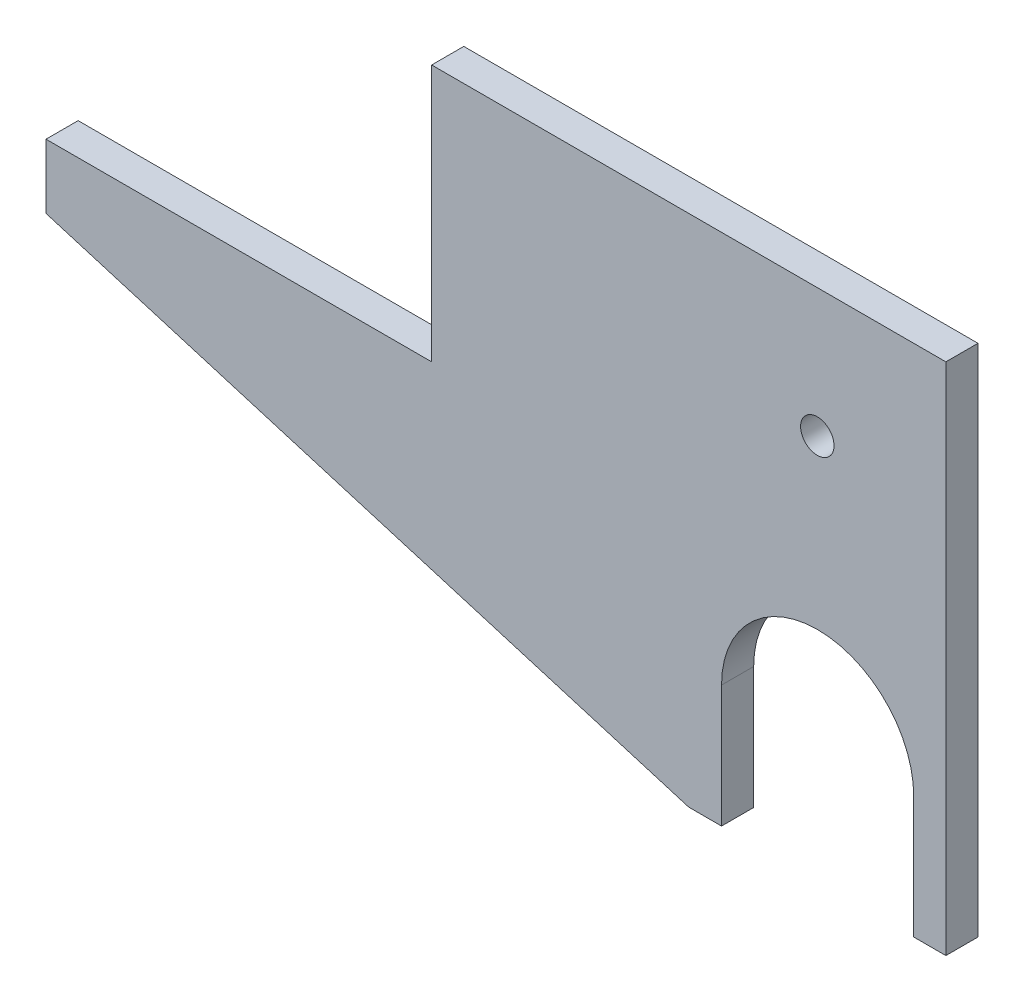
ISO-10303-21;
HEADER;
FILE_DESCRIPTION(('STEP AP214'),'2;1');
FILE_NAME('part.step','',(''),(''),'','','');
FILE_SCHEMA(('AUTOMOTIVE_DESIGN { 1 0 10303 214 1 1 1 1 }'));
ENDSEC;
DATA;
#1=APPLICATION_CONTEXT('core data for automotive mechanical design processes');
#2=APPLICATION_PROTOCOL_DEFINITION('international standard','automotive_design',2000,#1);
#3=PRODUCT_CONTEXT('',#1,'mechanical');
#4=PRODUCT('Part','Part','',(#3));
#5=PRODUCT_RELATED_PRODUCT_CATEGORY('part','',(#4));
#6=PRODUCT_DEFINITION_FORMATION('','',#4);
#7=PRODUCT_DEFINITION_CONTEXT('part definition',#1,'design');
#8=PRODUCT_DEFINITION('design','',#6,#7);
#9=PRODUCT_DEFINITION_SHAPE('','',#8);
#10=(LENGTH_UNIT() NAMED_UNIT(*) SI_UNIT(.MILLI.,.METRE.));
#11=(NAMED_UNIT(*) PLANE_ANGLE_UNIT() SI_UNIT($,.RADIAN.));
#12=(NAMED_UNIT(*) SI_UNIT($,.STERADIAN.) SOLID_ANGLE_UNIT());
#13=UNCERTAINTY_MEASURE_WITH_UNIT(LENGTH_MEASURE(1.E-05),#10,'distance_accuracy_value','');
#14=(GEOMETRIC_REPRESENTATION_CONTEXT(3) GLOBAL_UNCERTAINTY_ASSIGNED_CONTEXT((#13)) GLOBAL_UNIT_ASSIGNED_CONTEXT((#10,
#11,#12)) REPRESENTATION_CONTEXT('',''));
#15=CARTESIAN_POINT('',(0.,0.,0.));
#16=DIRECTION('',(0.,0.,1.));
#17=DIRECTION('',(1.,0.,0.));
#18=AXIS2_PLACEMENT_3D('',#15,#16,#17);
#19=CARTESIAN_POINT('',(990.663500000006,-26.6699999999984,6.34999999999986));
#20=DIRECTION('',(0.,0.,-1.));
#21=DIRECTION('',(-1.00000000000001,0.,0.));
#22=AXIS2_PLACEMENT_3D('',#19,#20,#21);
#23=CYLINDRICAL_SURFACE('',#22,18.9865);
#24=CARTESIAN_POINT('',(990.663500000006,-26.6699999999984,0.));
#25=DIRECTION('',(0.,0.,1.));
#26=DIRECTION('',(1.00000000000001,0.,0.));
#27=AXIS2_PLACEMENT_3D('',#24,#25,#26);
#28=CIRCLE('',#27,18.9865);
#29=CARTESIAN_POINT('',(1009.65000000001,-26.6699999999984,7.7715611723761E-13));
#30=VERTEX_POINT('',#29);
#31=CARTESIAN_POINT('',(971.677000000006,-26.6699999999984,0.));
#32=VERTEX_POINT('',#31);
#33=EDGE_CURVE('E149',#30,#32,#28,.T.);
#34=ORIENTED_EDGE('',*,*,#33,.F.);
#35=DIRECTION('',(0.,0.,-1.));
#36=VECTOR('',#35,1.);
#37=CARTESIAN_POINT('',(1009.65000000001,-26.6699999999984,6.34999999999986));
#38=LINE('',#37,#36);
#39=CARTESIAN_POINT('',(1009.65000000001,-26.6699999999984,6.34999999999986));
#40=VERTEX_POINT('',#39);
#41=EDGE_CURVE('E11',#40,#30,#38,.T.);
#42=ORIENTED_EDGE('',*,*,#41,.F.);
#43=CARTESIAN_POINT('',(990.663500000006,-26.6699999999984,6.34999999999986));
#44=DIRECTION('',(0.,0.,1.));
#45=DIRECTION('',(1.00000000000001,0.,0.));
#46=AXIS2_PLACEMENT_3D('',#43,#44,#45);
#47=CIRCLE('',#46,18.9865);
#48=CARTESIAN_POINT('',(971.677000000006,-26.6699999999984,6.34999999999986));
#49=VERTEX_POINT('',#48);
#50=EDGE_CURVE('E178',#40,#49,#47,.T.);
#51=ORIENTED_EDGE('',*,*,#50,.T.);
#52=DIRECTION('',(0.,0.,-1.));
#53=VECTOR('',#52,1.);
#54=CARTESIAN_POINT('',(971.677000000006,-26.6699999999984,6.34999999999986));
#55=LINE('',#54,#53);
#56=EDGE_CURVE('E52',#49,#32,#55,.T.);
#57=ORIENTED_EDGE('',*,*,#56,.T.);
#58=EDGE_LOOP('',(#34,#42,#51,#57));
#59=FACE_BOUND('',#58,.T.);
#60=ADVANCED_FACE('F36',(#59),#23,.F.);
#61=CARTESIAN_POINT('',(1009.65000000001,0.,6.34999999999986));
#62=DIRECTION('',(1.00000000000001,0.,0.));
#63=DIRECTION('',(0.,0.,-1.));
#64=AXIS2_PLACEMENT_3D('',#61,#62,#63);
#65=PLANE('',#64);
#66=DIRECTION('',(0.,-1.00000000000001,0.));
#67=VECTOR('',#66,1.);
#68=CARTESIAN_POINT('',(1009.65000000001,0.,7.7715611723761E-13));
#69=LINE('',#68,#67);
#70=CARTESIAN_POINT('',(1009.65000000001,-50.7999999999986,7.7715611723761E-13));
#71=VERTEX_POINT('',#70);
#72=EDGE_CURVE('E151',#30,#71,#69,.T.);
#73=ORIENTED_EDGE('',*,*,#72,.T.);
#74=DIRECTION('',(0.,0.,-1.));
#75=VECTOR('',#74,1.);
#76=CARTESIAN_POINT('',(1009.65000000001,-50.7999999999986,6.34999999999986));
#77=LINE('',#76,#75);
#78=CARTESIAN_POINT('',(1009.65000000001,-50.7999999999986,6.34999999999986));
#79=VERTEX_POINT('',#78);
#80=EDGE_CURVE('E44',#79,#71,#77,.T.);
#81=ORIENTED_EDGE('',*,*,#80,.F.);
#82=DIRECTION('',(0.,-1.00000000000001,0.));
#83=VECTOR('',#82,1.);
#84=CARTESIAN_POINT('',(1009.65000000001,0.,6.34999999999986));
#85=LINE('',#84,#83);
#86=EDGE_CURVE('E212',#40,#79,#85,.T.);
#87=ORIENTED_EDGE('',*,*,#86,.F.);
#88=ORIENTED_EDGE('',*,*,#41,.T.);
#89=EDGE_LOOP('',(#73,#81,#87,#88));
#90=FACE_BOUND('',#89,.T.);
#91=ADVANCED_FACE('F200',(#90),#65,.F.);
#92=CARTESIAN_POINT('',(-9.88098491916389E-12,-50.7999999998022,6.34999999999986));
#93=DIRECTION('',(-1.94507577148895E-13,-1.00000000000001,0.));
#94=DIRECTION('',(1.00000000000001,-1.94507577148895E-13,0.));
#95=AXIS2_PLACEMENT_3D('',#92,#93,#94);
#96=PLANE('',#95);
#97=DIRECTION('',(-1.00000000000001,1.94507577148895E-13,0.));
#98=VECTOR('',#97,1.);
#99=CARTESIAN_POINT('',(-9.88098491916389E-12,-50.7999999998022,0.));
#100=LINE('',#99,#98);
#101=CARTESIAN_POINT('',(1016.00000000001,-50.7999999999998,0.));
#102=VERTEX_POINT('',#101);
#103=EDGE_CURVE('E155',#102,#71,#100,.T.);
#104=ORIENTED_EDGE('',*,*,#103,.F.);
#105=DIRECTION('',(0.,0.,-1.));
#106=VECTOR('',#105,1.);
#107=CARTESIAN_POINT('',(1016.00000000001,-50.7999999999998,6.34999999999986));
#108=LINE('',#107,#106);
#109=CARTESIAN_POINT('',(1016.00000000001,-50.7999999999998,6.34999999999986));
#110=VERTEX_POINT('',#109);
#111=EDGE_CURVE('E190',#110,#102,#108,.T.);
#112=ORIENTED_EDGE('',*,*,#111,.F.);
#113=DIRECTION('',(-1.00000000000001,1.94507577148895E-13,0.));
#114=VECTOR('',#113,1.);
#115=CARTESIAN_POINT('',(-9.88098491916389E-12,-50.7999999998022,6.34999999999986));
#116=LINE('',#115,#114);
#117=EDGE_CURVE('E197',#110,#79,#116,.T.);
#118=ORIENTED_EDGE('',*,*,#117,.T.);
#119=ORIENTED_EDGE('',*,*,#80,.T.);
#120=EDGE_LOOP('',(#104,#112,#118,#119));
#121=FACE_BOUND('',#120,.T.);
#122=ADVANCED_FACE('F195',(#121),#96,.T.);
#123=CARTESIAN_POINT('',(1016.00000000001,0.,6.34999999999986));
#124=DIRECTION('',(1.00000000000001,0.,0.));
#125=DIRECTION('',(0.,0.,-1.));
#126=AXIS2_PLACEMENT_3D('',#123,#124,#125);
#127=PLANE('',#126);
#128=DIRECTION('',(0.,-1.00000000000001,0.));
#129=VECTOR('',#128,1.);
#130=CARTESIAN_POINT('',(1016.00000000001,0.,0.));
#131=LINE('',#130,#129);
#132=CARTESIAN_POINT('',(1016.00000000001,50.8000000000024,0.));
#133=VERTEX_POINT('',#132);
#134=EDGE_CURVE('E158',#133,#102,#131,.T.);
#135=ORIENTED_EDGE('',*,*,#134,.F.);
#136=DIRECTION('',(0.,0.,-1.));
#137=VECTOR('',#136,1.);
#138=CARTESIAN_POINT('',(1016.00000000001,50.8000000000024,6.34999999999986));
#139=LINE('',#138,#137);
#140=CARTESIAN_POINT('',(1016.00000000001,50.8000000000024,6.34999999999986));
#141=VERTEX_POINT('',#140);
#142=EDGE_CURVE('E188',#141,#133,#139,.T.);
#143=ORIENTED_EDGE('',*,*,#142,.F.);
#144=DIRECTION('',(0.,-1.00000000000001,0.));
#145=VECTOR('',#144,1.);
#146=CARTESIAN_POINT('',(1016.00000000001,0.,6.34999999999986));
#147=LINE('',#146,#145);
#148=EDGE_CURVE('E209',#141,#110,#147,.T.);
#149=ORIENTED_EDGE('',*,*,#148,.T.);
#150=ORIENTED_EDGE('',*,*,#111,.T.);
#151=EDGE_LOOP('',(#135,#143,#149,#150));
#152=FACE_BOUND('',#151,.T.);
#153=ADVANCED_FACE('F206',(#152),#127,.T.);
#154=CARTESIAN_POINT('',(0.,50.8000000000025,6.34999999999986));
#155=DIRECTION('',(0.,1.00000000000001,0.));
#156=DIRECTION('',(-1.00000000000001,0.,0.));
#157=AXIS2_PLACEMENT_3D('',#154,#155,#156);
#158=PLANE('',#157);
#159=DIRECTION('',(1.00000000000001,0.,0.));
#160=VECTOR('',#159,1.);
#161=CARTESIAN_POINT('',(0.,50.8000000000025,0.));
#162=LINE('',#161,#160);
#163=CARTESIAN_POINT('',(914.400000000006,50.8000000000011,7.7715611723761E-13));
#164=VERTEX_POINT('',#163);
#165=EDGE_CURVE('E161',#164,#133,#162,.T.);
#166=ORIENTED_EDGE('',*,*,#165,.F.);
#167=DIRECTION('',(0.,0.,-1.));
#168=VECTOR('',#167,1.);
#169=CARTESIAN_POINT('',(914.400000000006,50.8000000000011,6.34999999999997));
#170=LINE('',#169,#168);
#171=CARTESIAN_POINT('',(914.400000000006,50.8000000000011,6.34999999999997));
#172=VERTEX_POINT('',#171);
#173=EDGE_CURVE('E186',#172,#164,#170,.T.);
#174=ORIENTED_EDGE('',*,*,#173,.F.);
#175=DIRECTION('',(1.00000000000001,0.,0.));
#176=VECTOR('',#175,1.);
#177=CARTESIAN_POINT('',(0.,50.8000000000025,6.34999999999986));
#178=LINE('',#177,#176);
#179=EDGE_CURVE('E214',#172,#141,#178,.T.);
#180=ORIENTED_EDGE('',*,*,#179,.T.);
#181=ORIENTED_EDGE('',*,*,#142,.T.);
#182=EDGE_LOOP('',(#166,#174,#180,#181));
#183=FACE_BOUND('',#182,.T.);
#184=ADVANCED_FACE('F305',(#183),#158,.T.);
#185=CARTESIAN_POINT('',(914.400000000006,0.,6.34999999999997));
#186=DIRECTION('',(-1.00000000000001,0.,0.));
#187=DIRECTION('',(0.,0.,1.));
#188=AXIS2_PLACEMENT_3D('',#185,#186,#187);
#189=PLANE('',#188);
#190=DIRECTION('',(0.,1.00000000000001,0.));
#191=VECTOR('',#190,1.);
#192=CARTESIAN_POINT('',(914.400000000006,0.,7.7715611723761E-13));
#193=LINE('',#192,#191);
#194=CARTESIAN_POINT('',(914.400000000006,2.83106871279415E-12,7.7715611723761E-13));
#195=VERTEX_POINT('',#194);
#196=EDGE_CURVE('E164',#195,#164,#193,.T.);
#197=ORIENTED_EDGE('',*,*,#196,.F.);
#198=DIRECTION('',(0.,0.,-1.));
#199=VECTOR('',#198,1.);
#200=CARTESIAN_POINT('',(914.400000000006,2.83106871279415E-12,6.34999999999997));
#201=LINE('',#200,#199);
#202=CARTESIAN_POINT('',(914.400000000006,2.83106871279415E-12,6.34999999999997));
#203=VERTEX_POINT('',#202);
#204=EDGE_CURVE('E184',#203,#195,#201,.T.);
#205=ORIENTED_EDGE('',*,*,#204,.F.);
#206=DIRECTION('',(0.,1.00000000000001,0.));
#207=VECTOR('',#206,1.);
#208=CARTESIAN_POINT('',(914.400000000006,0.,6.34999999999997));
#209=LINE('',#208,#207);
#210=EDGE_CURVE('E220',#203,#172,#209,.T.);
#211=ORIENTED_EDGE('',*,*,#210,.T.);
#212=ORIENTED_EDGE('',*,*,#173,.T.);
#213=EDGE_LOOP('',(#197,#205,#211,#212));
#214=FACE_BOUND('',#213,.T.);
#215=ADVANCED_FACE('F231',(#214),#189,.T.);
#216=CARTESIAN_POINT('',(0.,2.60902410786912E-12,6.34999999999986));
#217=DIRECTION('',(0.,1.00000000000001,0.));
#218=DIRECTION('',(-1.00000000000001,0.,0.));
#219=AXIS2_PLACEMENT_3D('',#216,#217,#218);
#220=PLANE('',#219);
#221=DIRECTION('',(1.00000000000001,0.,0.));
#222=VECTOR('',#221,1.);
#223=CARTESIAN_POINT('',(0.,2.60902410786912E-12,0.));
#224=LINE('',#223,#222);
#225=CARTESIAN_POINT('',(838.200000000006,2.83106871279415E-12,7.7715611723761E-13));
#226=VERTEX_POINT('',#225);
#227=EDGE_CURVE('E167',#226,#195,#224,.T.);
#228=ORIENTED_EDGE('',*,*,#227,.F.);
#229=DIRECTION('',(0.,0.,-1.));
#230=VECTOR('',#229,1.);
#231=CARTESIAN_POINT('',(838.200000000006,2.83106871279415E-12,6.34999999999997));
#232=LINE('',#231,#230);
#233=CARTESIAN_POINT('',(838.200000000006,2.83106871279415E-12,6.34999999999997));
#234=VERTEX_POINT('',#233);
#235=EDGE_CURVE('E182',#234,#226,#232,.T.);
#236=ORIENTED_EDGE('',*,*,#235,.F.);
#237=DIRECTION('',(1.00000000000001,0.,0.));
#238=VECTOR('',#237,1.);
#239=CARTESIAN_POINT('',(0.,2.60902410786912E-12,6.34999999999986));
#240=LINE('',#239,#238);
#241=EDGE_CURVE('E223',#234,#203,#240,.T.);
#242=ORIENTED_EDGE('',*,*,#241,.T.);
#243=ORIENTED_EDGE('',*,*,#204,.T.);
#244=EDGE_LOOP('',(#228,#236,#242,#243));
#245=FACE_BOUND('',#244,.T.);
#246=ADVANCED_FACE('F227',(#245),#220,.T.);
#247=CARTESIAN_POINT('',(838.200000000006,-7.32747196252603E-12,6.34999999999997));
#248=DIRECTION('',(1.00000000000001,0.,0.));
#249=DIRECTION('',(0.,1.00000000000001,0.));
#250=AXIS2_PLACEMENT_3D('',#247,#248,#249);
#251=PLANE('',#250);
#252=DIRECTION('',(0.,-1.00000000000001,0.));
#253=VECTOR('',#252,1.);
#254=CARTESIAN_POINT('',(838.200000000006,-7.32747196252603E-12,7.7715611723761E-13));
#255=LINE('',#254,#253);
#256=CARTESIAN_POINT('',(838.200000000006,-12.6999999999972,7.7715611723761E-13));
#257=VERTEX_POINT('',#256);
#258=EDGE_CURVE('E170',#226,#257,#255,.T.);
#259=ORIENTED_EDGE('',*,*,#258,.T.);
#260=DIRECTION('',(0.,0.,-1.));
#261=VECTOR('',#260,1.);
#262=CARTESIAN_POINT('',(838.200000000006,-12.6999999999972,6.34999999999997));
#263=LINE('',#262,#261);
#264=CARTESIAN_POINT('',(838.200000000006,-12.6999999999972,6.34999999999997));
#265=VERTEX_POINT('',#264);
#266=EDGE_CURVE('E141',#265,#257,#263,.T.);
#267=ORIENTED_EDGE('',*,*,#266,.F.);
#268=DIRECTION('',(0.,-1.00000000000001,0.));
#269=VECTOR('',#268,1.);
#270=CARTESIAN_POINT('',(838.200000000006,-7.32747196252603E-12,6.34999999999997));
#271=LINE('',#270,#269);
#272=EDGE_CURVE('E129',#234,#265,#271,.T.);
#273=ORIENTED_EDGE('',*,*,#272,.F.);
#274=ORIENTED_EDGE('',*,*,#235,.T.);
#275=EDGE_LOOP('',(#259,#267,#273,#274));
#276=FACE_BOUND('',#275,.T.);
#277=ADVANCED_FACE('F234',(#276),#251,.F.);
#278=CARTESIAN_POINT('',(65.7137614678983,219.045871559649,6.34999999999986));
#279=DIRECTION('',(0.287347885566363,0.957826285221153,0.));
#280=DIRECTION('',(-0.957826285221153,0.287347885566363,0.));
#281=AXIS2_PLACEMENT_3D('',#278,#279,#280);
#282=PLANE('',#281);
#283=DIRECTION('',(0.957826285221153,-0.287347885566363,0.));
#284=VECTOR('',#283,1.);
#285=CARTESIAN_POINT('',(65.7137614678984,219.045871559649,0.));
#286=LINE('',#285,#284);
#287=CARTESIAN_POINT('',(965.200000000006,-50.7999999999998,7.7715611723761E-13));
#288=VERTEX_POINT('',#287);
#289=EDGE_CURVE('E138',#257,#288,#286,.T.);
#290=ORIENTED_EDGE('',*,*,#289,.T.);
#291=DIRECTION('',(0.,0.,-1.));
#292=VECTOR('',#291,1.);
#293=CARTESIAN_POINT('',(965.200000000006,-50.7999999999998,6.34999999999997));
#294=LINE('',#293,#292);
#295=CARTESIAN_POINT('',(965.200000000006,-50.7999999999998,6.34999999999997));
#296=VERTEX_POINT('',#295);
#297=EDGE_CURVE('E135',#296,#288,#294,.T.);
#298=ORIENTED_EDGE('',*,*,#297,.F.);
#299=DIRECTION('',(0.957826285221153,-0.287347885566363,0.));
#300=VECTOR('',#299,1.);
#301=CARTESIAN_POINT('',(65.7137614678983,219.045871559649,6.34999999999986));
#302=LINE('',#301,#300);
#303=EDGE_CURVE('E120',#265,#296,#302,.T.);
#304=ORIENTED_EDGE('',*,*,#303,.F.);
#305=ORIENTED_EDGE('',*,*,#266,.T.);
#306=EDGE_LOOP('',(#290,#298,#304,#305));
#307=FACE_BOUND('',#306,.T.);
#308=ADVANCED_FACE('F136',(#307),#282,.F.);
#309=CARTESIAN_POINT('',(9.38138455808257E-12,-50.8000000001786,6.34999999999986));
#310=DIRECTION('',(1.85337138393696E-13,-1.00000000000001,0.));
#311=DIRECTION('',(1.00000000000001,1.85337138393696E-13,0.));
#312=AXIS2_PLACEMENT_3D('',#309,#310,#311);
#313=PLANE('',#312);
#314=DIRECTION('',(-1.00000000000001,-1.85337138393696E-13,0.));
#315=VECTOR('',#314,1.);
#316=CARTESIAN_POINT('',(9.43689570931383E-12,-50.8000000001786,0.));
#317=LINE('',#316,#315);
#318=CARTESIAN_POINT('',(971.677000000006,-50.7999999999986,0.));
#319=VERTEX_POINT('',#318);
#320=EDGE_CURVE('E173',#319,#288,#317,.T.);
#321=ORIENTED_EDGE('',*,*,#320,.F.);
#322=DIRECTION('',(0.,0.,-1.));
#323=VECTOR('',#322,1.);
#324=CARTESIAN_POINT('',(971.677000000006,-50.7999999999986,6.34999999999986));
#325=LINE('',#324,#323);
#326=CARTESIAN_POINT('',(971.677000000006,-50.7999999999986,6.34999999999986));
#327=VERTEX_POINT('',#326);
#328=EDGE_CURVE('E86',#327,#319,#325,.T.);
#329=ORIENTED_EDGE('',*,*,#328,.F.);
#330=DIRECTION('',(-1.00000000000001,-1.85337138393696E-13,0.));
#331=VECTOR('',#330,1.);
#332=CARTESIAN_POINT('',(9.38138455808257E-12,-50.8000000001786,6.34999999999986));
#333=LINE('',#332,#331);
#334=EDGE_CURVE('E126',#327,#296,#333,.T.);
#335=ORIENTED_EDGE('',*,*,#334,.T.);
#336=ORIENTED_EDGE('',*,*,#297,.T.);
#337=EDGE_LOOP('',(#321,#329,#335,#336));
#338=FACE_BOUND('',#337,.T.);
#339=ADVANCED_FACE('F143',(#338),#313,.T.);
#340=CARTESIAN_POINT('',(971.677000000006,0.,6.34999999999986));
#341=DIRECTION('',(1.00000000000001,0.,0.));
#342=DIRECTION('',(0.,0.,-1.));
#343=AXIS2_PLACEMENT_3D('',#340,#341,#342);
#344=PLANE('',#343);
#345=DIRECTION('',(0.,-1.00000000000001,0.));
#346=VECTOR('',#345,1.);
#347=CARTESIAN_POINT('',(971.677000000006,0.,0.));
#348=LINE('',#347,#346);
#349=EDGE_CURVE('E175',#32,#319,#348,.T.);
#350=ORIENTED_EDGE('',*,*,#349,.F.);
#351=ORIENTED_EDGE('',*,*,#56,.F.);
#352=DIRECTION('',(0.,-1.00000000000001,0.));
#353=VECTOR('',#352,1.);
#354=CARTESIAN_POINT('',(971.677000000006,0.,6.34999999999986));
#355=LINE('',#354,#353);
#356=EDGE_CURVE('E144',#49,#327,#355,.T.);
#357=ORIENTED_EDGE('',*,*,#356,.T.);
#358=ORIENTED_EDGE('',*,*,#328,.T.);
#359=EDGE_LOOP('',(#350,#351,#357,#358));
#360=FACE_BOUND('',#359,.T.);
#361=ADVANCED_FACE('F247',(#360),#344,.T.);
#362=CARTESIAN_POINT('',(0.,0.,6.34999999999986));
#363=DIRECTION('',(0.,0.,1.));
#364=DIRECTION('',(1.00000000000001,0.,0.));
#365=AXIS2_PLACEMENT_3D('',#362,#363,#364);
#366=PLANE('',#365);
#367=CARTESIAN_POINT('',(990.600000000008,25.3999999999987,6.34999999999986));
#368=DIRECTION('',(0.,0.,1.));
#369=DIRECTION('',(1.00000000000001,0.,0.));
#370=AXIS2_PLACEMENT_3D('',#367,#368,#369);
#371=CIRCLE('',#370,3.30199999999919);
#372=CARTESIAN_POINT('',(993.902000000007,25.3999999999987,6.34999999999986));
#373=VERTEX_POINT('',#372);
#374=EDGE_CURVE('E271',#373,#373,#371,.T.);
#375=ORIENTED_EDGE('',*,*,#374,.F.);
#376=EDGE_LOOP('',(#375));
#377=FACE_BOUND('',#376,.T.);
#378=ORIENTED_EDGE('',*,*,#50,.F.);
#379=ORIENTED_EDGE('',*,*,#86,.T.);
#380=ORIENTED_EDGE('',*,*,#117,.F.);
#381=ORIENTED_EDGE('',*,*,#148,.F.);
#382=ORIENTED_EDGE('',*,*,#179,.F.);
#383=ORIENTED_EDGE('',*,*,#210,.F.);
#384=ORIENTED_EDGE('',*,*,#241,.F.);
#385=ORIENTED_EDGE('',*,*,#272,.T.);
#386=ORIENTED_EDGE('',*,*,#303,.T.);
#387=ORIENTED_EDGE('',*,*,#334,.F.);
#388=ORIENTED_EDGE('',*,*,#356,.F.);
#389=EDGE_LOOP('',(#378,#379,#380,#381,#382,#383,#384,#385,#386,#387,#388));
#390=FACE_BOUND('',#389,.T.);
#391=ADVANCED_FACE('F123',(#377,#390),#366,.T.);
#392=CARTESIAN_POINT('',(0.,0.,0.));
#393=DIRECTION('',(0.,0.,1.));
#394=DIRECTION('',(1.00000000000001,0.,0.));
#395=AXIS2_PLACEMENT_3D('',#392,#393,#394);
#396=PLANE('',#395);
#397=CARTESIAN_POINT('',(990.600000000008,25.3999999999987,0.));
#398=DIRECTION('',(0.,0.,1.));
#399=DIRECTION('',(1.00000000000001,0.,0.));
#400=AXIS2_PLACEMENT_3D('',#397,#398,#399);
#401=CIRCLE('',#400,3.30199999999919);
#402=CARTESIAN_POINT('',(993.902000000007,25.3999999999987,0.));
#403=VERTEX_POINT('',#402);
#404=EDGE_CURVE('E152',#403,#403,#401,.T.);
#405=ORIENTED_EDGE('',*,*,#404,.T.);
#406=EDGE_LOOP('',(#405));
#407=FACE_BOUND('',#406,.T.);
#408=ORIENTED_EDGE('',*,*,#33,.T.);
#409=ORIENTED_EDGE('',*,*,#349,.T.);
#410=ORIENTED_EDGE('',*,*,#320,.T.);
#411=ORIENTED_EDGE('',*,*,#289,.F.);
#412=ORIENTED_EDGE('',*,*,#258,.F.);
#413=ORIENTED_EDGE('',*,*,#227,.T.);
#414=ORIENTED_EDGE('',*,*,#196,.T.);
#415=ORIENTED_EDGE('',*,*,#165,.T.);
#416=ORIENTED_EDGE('',*,*,#134,.T.);
#417=ORIENTED_EDGE('',*,*,#103,.T.);
#418=ORIENTED_EDGE('',*,*,#72,.F.);
#419=EDGE_LOOP('',(#408,#409,#410,#411,#412,#413,#414,#415,#416,#417,#418));
#420=FACE_BOUND('',#419,.T.);
#421=ADVANCED_FACE('F202',(#407,#420),#396,.F.);
#422=CARTESIAN_POINT('',(990.600000000008,25.3999999999987,0.));
#423=DIRECTION('',(0.,0.,1.));
#424=DIRECTION('',(1.00000000000001,0.,0.));
#425=AXIS2_PLACEMENT_3D('',#422,#423,#424);
#426=CYLINDRICAL_SURFACE('',#425,3.30199999999919);
#427=ORIENTED_EDGE('',*,*,#404,.F.);
#428=EDGE_LOOP('',(#427));
#429=FACE_BOUND('',#428,.T.);
#430=ORIENTED_EDGE('',*,*,#374,.T.);
#431=EDGE_LOOP('',(#430));
#432=FACE_BOUND('',#431,.T.);
#433=ADVANCED_FACE('F259',(#429,#432),#426,.F.);
#434=CLOSED_SHELL('',(#60,#91,#122,#153,#184,#215,#246,#277,#308,#339,#361,#391,#421,#433));
#435=MANIFOLD_SOLID_BREP('B2',#434);
#436=ADVANCED_BREP_SHAPE_REPRESENTATION('',(#18,#435),#14);
#437=SHAPE_DEFINITION_REPRESENTATION(#9,#436);
ENDSEC;
END-ISO-10303-21;
